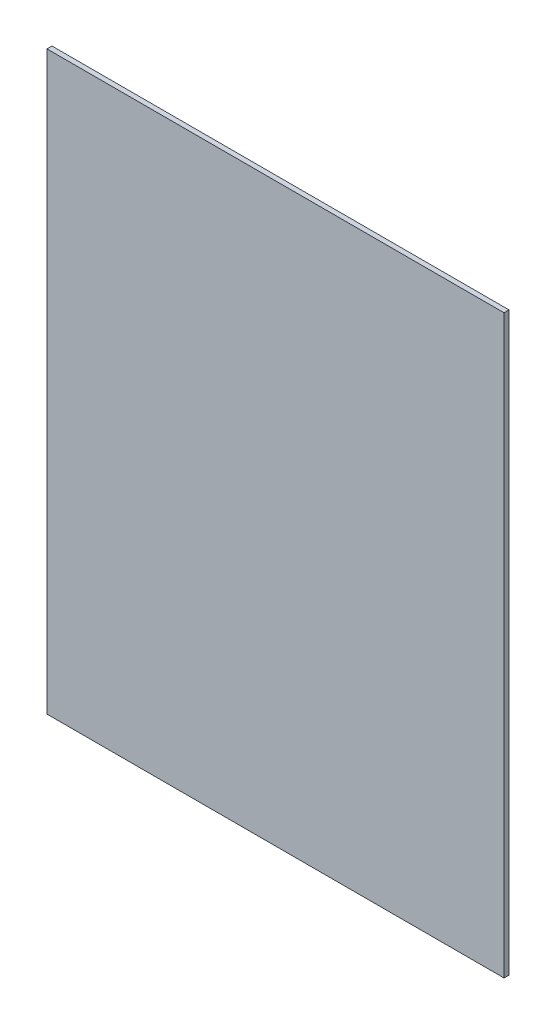
ISO-10303-21;
HEADER;
FILE_DESCRIPTION(('STEP AP214'),'2;1');
FILE_NAME('part.step','',(''),(''),'','','');
FILE_SCHEMA(('AUTOMOTIVE_DESIGN { 1 0 10303 214 1 1 1 1 }'));
ENDSEC;
DATA;
#1=APPLICATION_CONTEXT('core data for automotive mechanical design processes');
#2=APPLICATION_PROTOCOL_DEFINITION('international standard','automotive_design',2000,#1);
#3=PRODUCT_CONTEXT('',#1,'mechanical');
#4=PRODUCT('Part','Part','',(#3));
#5=PRODUCT_RELATED_PRODUCT_CATEGORY('part','',(#4));
#6=PRODUCT_DEFINITION_FORMATION('','',#4);
#7=PRODUCT_DEFINITION_CONTEXT('part definition',#1,'design');
#8=PRODUCT_DEFINITION('design','',#6,#7);
#9=PRODUCT_DEFINITION_SHAPE('','',#8);
#10=(LENGTH_UNIT() NAMED_UNIT(*) SI_UNIT(.MILLI.,.METRE.));
#11=(NAMED_UNIT(*) PLANE_ANGLE_UNIT() SI_UNIT($,.RADIAN.));
#12=(NAMED_UNIT(*) SI_UNIT($,.STERADIAN.) SOLID_ANGLE_UNIT());
#13=UNCERTAINTY_MEASURE_WITH_UNIT(LENGTH_MEASURE(1.E-05),#10,'distance_accuracy_value','');
#14=(GEOMETRIC_REPRESENTATION_CONTEXT(3) GLOBAL_UNCERTAINTY_ASSIGNED_CONTEXT((#13)) GLOBAL_UNIT_ASSIGNED_CONTEXT((#10,
#11,#12)) REPRESENTATION_CONTEXT('',''));
#15=CARTESIAN_POINT('',(0.,0.,0.));
#16=DIRECTION('',(0.,0.,1.));
#17=DIRECTION('',(1.,0.,0.));
#18=AXIS2_PLACEMENT_3D('',#15,#16,#17);
#19=CARTESIAN_POINT('',(-119.,300.,-1.29999999999998));
#20=DIRECTION('',(1.,0.,0.));
#21=DIRECTION('',(0.,0.,-1.));
#22=AXIS2_PLACEMENT_3D('',#19,#20,#21);
#23=PLANE('',#22);
#24=DIRECTION('',(0.,0.,1.));
#25=VECTOR('',#24,1.);
#26=CARTESIAN_POINT('',(-119.,0.,-1.29999999999998));
#27=LINE('',#26,#25);
#28=CARTESIAN_POINT('',(-119.,0.,-1.29999999999998));
#29=VERTEX_POINT('',#28);
#30=CARTESIAN_POINT('',(-119.,0.,1.30000000000001));
#31=VERTEX_POINT('',#30);
#32=EDGE_CURVE('E96',#29,#31,#27,.T.);
#33=ORIENTED_EDGE('',*,*,#32,.T.);
#34=DIRECTION('',(0.,-1.,0.));
#35=VECTOR('',#34,1.);
#36=CARTESIAN_POINT('',(-119.,300.,1.30000000000001));
#37=LINE('',#36,#35);
#38=CARTESIAN_POINT('',(-119.,300.,1.30000000000001));
#39=VERTEX_POINT('',#38);
#40=EDGE_CURVE('E11',#39,#31,#37,.T.);
#41=ORIENTED_EDGE('',*,*,#40,.F.);
#42=DIRECTION('',(0.,0.,1.));
#43=VECTOR('',#42,1.);
#44=CARTESIAN_POINT('',(-119.,300.,-1.29999999999998));
#45=LINE('',#44,#43);
#46=CARTESIAN_POINT('',(-119.,300.,-1.29999999999998));
#47=VERTEX_POINT('',#46);
#48=EDGE_CURVE('E84',#47,#39,#45,.T.);
#49=ORIENTED_EDGE('',*,*,#48,.F.);
#50=DIRECTION('',(0.,-1.,0.));
#51=VECTOR('',#50,1.);
#52=CARTESIAN_POINT('',(-119.,300.,-1.29999999999998));
#53=LINE('',#52,#51);
#54=EDGE_CURVE('E92',#47,#29,#53,.T.);
#55=ORIENTED_EDGE('',*,*,#54,.T.);
#56=EDGE_LOOP('',(#33,#41,#49,#55));
#57=FACE_BOUND('',#56,.T.);
#58=ADVANCED_FACE('F33',(#57),#23,.F.);
#59=CARTESIAN_POINT('',(119.,300.,1.29999999999999));
#60=DIRECTION('',(0.,0.,-1.));
#61=DIRECTION('',(-1.,0.,0.));
#62=AXIS2_PLACEMENT_3D('',#59,#60,#61);
#63=PLANE('',#62);
#64=DIRECTION('',(1.,0.,0.));
#65=VECTOR('',#64,1.);
#66=CARTESIAN_POINT('',(119.,0.,1.29999999999999));
#67=LINE('',#66,#65);
#68=CARTESIAN_POINT('',(119.,0.,1.29999999999999));
#69=VERTEX_POINT('',#68);
#70=EDGE_CURVE('E88',#31,#69,#67,.T.);
#71=ORIENTED_EDGE('',*,*,#70,.T.);
#72=DIRECTION('',(0.,-1.,0.));
#73=VECTOR('',#72,1.);
#74=CARTESIAN_POINT('',(119.,300.,1.29999999999999));
#75=LINE('',#74,#73);
#76=CARTESIAN_POINT('',(119.,300.,1.29999999999999));
#77=VERTEX_POINT('',#76);
#78=EDGE_CURVE('E41',#77,#69,#75,.T.);
#79=ORIENTED_EDGE('',*,*,#78,.F.);
#80=DIRECTION('',(1.,0.,0.));
#81=VECTOR('',#80,1.);
#82=CARTESIAN_POINT('',(119.,300.,1.29999999999999));
#83=LINE('',#82,#81);
#84=EDGE_CURVE('E79',#39,#77,#83,.T.);
#85=ORIENTED_EDGE('',*,*,#84,.F.);
#86=ORIENTED_EDGE('',*,*,#40,.T.);
#87=EDGE_LOOP('',(#71,#79,#85,#86));
#88=FACE_BOUND('',#87,.T.);
#89=ADVANCED_FACE('F87',(#88),#63,.F.);
#90=CARTESIAN_POINT('',(119.,300.,-1.30000000000001));
#91=DIRECTION('',(-1.,0.,0.));
#92=DIRECTION('',(0.,0.,1.));
#93=AXIS2_PLACEMENT_3D('',#90,#91,#92);
#94=PLANE('',#93);
#95=DIRECTION('',(0.,0.,-1.));
#96=VECTOR('',#95,1.);
#97=CARTESIAN_POINT('',(119.,0.,-1.30000000000001));
#98=LINE('',#97,#96);
#99=CARTESIAN_POINT('',(119.,0.,-1.30000000000001));
#100=VERTEX_POINT('',#99);
#101=EDGE_CURVE('E66',#69,#100,#98,.T.);
#102=ORIENTED_EDGE('',*,*,#101,.T.);
#103=DIRECTION('',(0.,-1.,0.));
#104=VECTOR('',#103,1.);
#105=CARTESIAN_POINT('',(119.,300.,-1.30000000000001));
#106=LINE('',#105,#104);
#107=CARTESIAN_POINT('',(119.,300.,-1.30000000000001));
#108=VERTEX_POINT('',#107);
#109=EDGE_CURVE('E89',#108,#100,#106,.T.);
#110=ORIENTED_EDGE('',*,*,#109,.F.);
#111=DIRECTION('',(0.,0.,-1.));
#112=VECTOR('',#111,1.);
#113=CARTESIAN_POINT('',(119.,300.,-1.30000000000001));
#114=LINE('',#113,#112);
#115=EDGE_CURVE('E82',#77,#108,#114,.T.);
#116=ORIENTED_EDGE('',*,*,#115,.F.);
#117=ORIENTED_EDGE('',*,*,#78,.T.);
#118=EDGE_LOOP('',(#102,#110,#116,#117));
#119=FACE_BOUND('',#118,.T.);
#120=ADVANCED_FACE('F90',(#119),#94,.F.);
#121=CARTESIAN_POINT('',(119.,300.,-1.30000000000001));
#122=DIRECTION('',(0.,0.,1.));
#123=DIRECTION('',(1.,0.,0.));
#124=AXIS2_PLACEMENT_3D('',#121,#122,#123);
#125=PLANE('',#124);
#126=DIRECTION('',(-1.,0.,0.));
#127=VECTOR('',#126,1.);
#128=CARTESIAN_POINT('',(119.,0.,-1.30000000000001));
#129=LINE('',#128,#127);
#130=EDGE_CURVE('E72',#100,#29,#129,.T.);
#131=ORIENTED_EDGE('',*,*,#130,.T.);
#132=ORIENTED_EDGE('',*,*,#54,.F.);
#133=DIRECTION('',(-1.,0.,0.));
#134=VECTOR('',#133,1.);
#135=CARTESIAN_POINT('',(119.,300.,-1.30000000000001));
#136=LINE('',#135,#134);
#137=EDGE_CURVE('E49',#108,#47,#136,.T.);
#138=ORIENTED_EDGE('',*,*,#137,.F.);
#139=ORIENTED_EDGE('',*,*,#109,.T.);
#140=EDGE_LOOP('',(#131,#132,#138,#139));
#141=FACE_BOUND('',#140,.T.);
#142=ADVANCED_FACE('F103',(#141),#125,.F.);
#143=CARTESIAN_POINT('',(0.,300.,0.));
#144=DIRECTION('',(0.,-1.,0.));
#145=DIRECTION('',(0.,0.,-1.));
#146=AXIS2_PLACEMENT_3D('',#143,#144,#145);
#147=PLANE('',#146);
#148=ORIENTED_EDGE('',*,*,#48,.T.);
#149=ORIENTED_EDGE('',*,*,#84,.T.);
#150=ORIENTED_EDGE('',*,*,#115,.T.);
#151=ORIENTED_EDGE('',*,*,#137,.T.);
#152=EDGE_LOOP('',(#148,#149,#150,#151));
#153=FACE_BOUND('',#152,.T.);
#154=ADVANCED_FACE('F80',(#153),#147,.F.);
#155=CARTESIAN_POINT('',(0.,0.,0.));
#156=DIRECTION('',(0.,-1.,0.));
#157=DIRECTION('',(0.,0.,-1.));
#158=AXIS2_PLACEMENT_3D('',#155,#156,#157);
#159=PLANE('',#158);
#160=ORIENTED_EDGE('',*,*,#32,.F.);
#161=ORIENTED_EDGE('',*,*,#130,.F.);
#162=ORIENTED_EDGE('',*,*,#101,.F.);
#163=ORIENTED_EDGE('',*,*,#70,.F.);
#164=EDGE_LOOP('',(#160,#161,#162,#163));
#165=FACE_BOUND('',#164,.T.);
#166=ADVANCED_FACE('F106',(#165),#159,.T.);
#167=CLOSED_SHELL('',(#58,#89,#120,#142,#154,#166));
#168=MANIFOLD_SOLID_BREP('B2',#167);
#169=ADVANCED_BREP_SHAPE_REPRESENTATION('',(#18,#168),#14);
#170=SHAPE_DEFINITION_REPRESENTATION(#9,#169);
ENDSEC;
END-ISO-10303-21;
